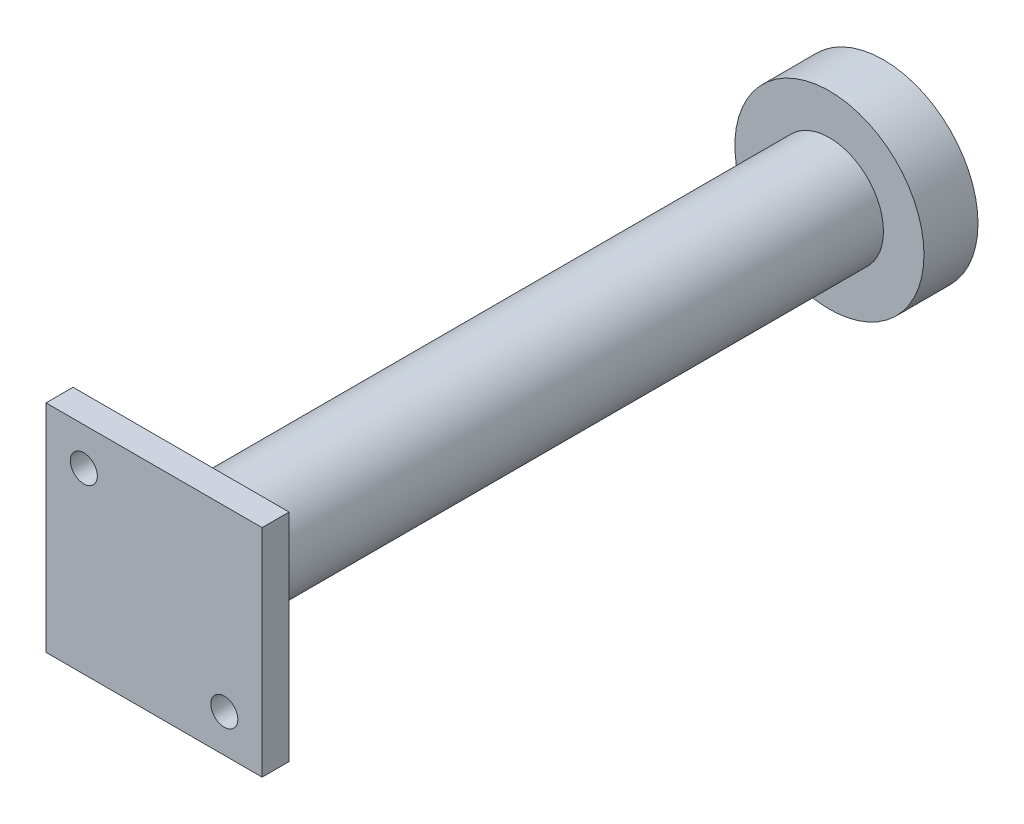
ISO-10303-21;
HEADER;
FILE_DESCRIPTION(('STEP AP214'),'2;1');
FILE_NAME('part.step','',(''),(''),'','','');
FILE_SCHEMA(('AUTOMOTIVE_DESIGN { 1 0 10303 214 1 1 1 1 }'));
ENDSEC;
DATA;
#1=APPLICATION_CONTEXT('core data for automotive mechanical design processes');
#2=APPLICATION_PROTOCOL_DEFINITION('international standard','automotive_design',2000,#1);
#3=PRODUCT_CONTEXT('',#1,'mechanical');
#4=PRODUCT('Part','Part','',(#3));
#5=PRODUCT_RELATED_PRODUCT_CATEGORY('part','',(#4));
#6=PRODUCT_DEFINITION_FORMATION('','',#4);
#7=PRODUCT_DEFINITION_CONTEXT('part definition',#1,'design');
#8=PRODUCT_DEFINITION('design','',#6,#7);
#9=PRODUCT_DEFINITION_SHAPE('','',#8);
#10=(LENGTH_UNIT() NAMED_UNIT(*) SI_UNIT(.MILLI.,.METRE.));
#11=(NAMED_UNIT(*) PLANE_ANGLE_UNIT() SI_UNIT($,.RADIAN.));
#12=(NAMED_UNIT(*) SI_UNIT($,.STERADIAN.) SOLID_ANGLE_UNIT());
#13=UNCERTAINTY_MEASURE_WITH_UNIT(LENGTH_MEASURE(1.E-05),#10,'distance_accuracy_value','');
#14=(GEOMETRIC_REPRESENTATION_CONTEXT(3) GLOBAL_UNCERTAINTY_ASSIGNED_CONTEXT((#13)) GLOBAL_UNIT_ASSIGNED_CONTEXT((#10,
#11,#12)) REPRESENTATION_CONTEXT('',''));
#15=CARTESIAN_POINT('',(0.,0.,0.));
#16=DIRECTION('',(0.,0.,1.));
#17=DIRECTION('',(1.,0.,0.));
#18=AXIS2_PLACEMENT_3D('',#15,#16,#17);
#19=CARTESIAN_POINT('',(0.,0.,100.));
#20=DIRECTION('',(0.,0.,-1.));
#21=DIRECTION('',(-1.,0.,0.));
#22=AXIS2_PLACEMENT_3D('',#19,#20,#21);
#23=CYLINDRICAL_SURFACE('',#22,10.);
#24=CARTESIAN_POINT('',(0.,0.,100.));
#25=DIRECTION('',(0.,0.,1.));
#26=DIRECTION('',(1.,0.,0.));
#27=AXIS2_PLACEMENT_3D('',#24,#25,#26);
#28=CIRCLE('',#27,10.);
#29=CARTESIAN_POINT('',(10.,0.,100.));
#30=VERTEX_POINT('',#29);
#31=EDGE_CURVE('E12',#30,#30,#28,.T.);
#32=ORIENTED_EDGE('',*,*,#31,.F.);
#33=EDGE_LOOP('',(#32));
#34=FACE_BOUND('',#33,.T.);
#35=CARTESIAN_POINT('',(0.,0.,-20.));
#36=DIRECTION('',(0.,0.,1.));
#37=DIRECTION('',(1.,0.,0.));
#38=AXIS2_PLACEMENT_3D('',#35,#36,#37);
#39=CIRCLE('',#38,10.);
#40=CARTESIAN_POINT('',(10.,0.,-20.));
#41=VERTEX_POINT('',#40);
#42=EDGE_CURVE('E124',#41,#41,#39,.T.);
#43=ORIENTED_EDGE('',*,*,#42,.T.);
#44=EDGE_LOOP('',(#43));
#45=FACE_BOUND('',#44,.T.);
#46=ADVANCED_FACE('F34',(#34,#45),#23,.T.);
#47=CARTESIAN_POINT('',(0.,0.,100.));
#48=DIRECTION('',(0.,0.,1.));
#49=DIRECTION('',(1.,0.,0.));
#50=AXIS2_PLACEMENT_3D('',#47,#48,#49);
#51=PLANE('',#50);
#52=CARTESIAN_POINT('',(13.,-13.,100.));
#53=DIRECTION('',(0.,0.,1.));
#54=DIRECTION('',(1.,0.,0.));
#55=AXIS2_PLACEMENT_3D('',#52,#53,#54);
#56=CIRCLE('',#55,2.5);
#57=CARTESIAN_POINT('',(15.5,-13.,100.));
#58=VERTEX_POINT('',#57);
#59=EDGE_CURVE('E126',#58,#58,#56,.T.);
#60=ORIENTED_EDGE('',*,*,#59,.T.);
#61=EDGE_LOOP('',(#60));
#62=FACE_BOUND('',#61,.T.);
#63=CARTESIAN_POINT('',(-13.,13.,100.));
#64=DIRECTION('',(0.,0.,1.));
#65=DIRECTION('',(1.,0.,0.));
#66=AXIS2_PLACEMENT_3D('',#63,#64,#65);
#67=CIRCLE('',#66,2.5);
#68=CARTESIAN_POINT('',(-10.5,13.,100.));
#69=VERTEX_POINT('',#68);
#70=EDGE_CURVE('E105',#69,#69,#67,.T.);
#71=ORIENTED_EDGE('',*,*,#70,.T.);
#72=EDGE_LOOP('',(#71));
#73=FACE_BOUND('',#72,.T.);
#74=DIRECTION('',(0.,-1.,0.));
#75=VECTOR('',#74,1.);
#76=CARTESIAN_POINT('',(-20.,20.,100.));
#77=LINE('',#76,#75);
#78=CARTESIAN_POINT('',(-20.,20.,100.));
#79=VERTEX_POINT('',#78);
#80=CARTESIAN_POINT('',(-20.,-20.,100.));
#81=VERTEX_POINT('',#80);
#82=EDGE_CURVE('E102',#79,#81,#77,.T.);
#83=ORIENTED_EDGE('',*,*,#82,.F.);
#84=DIRECTION('',(-1.,0.,0.));
#85=VECTOR('',#84,1.);
#86=CARTESIAN_POINT('',(-20.,20.,100.));
#87=LINE('',#86,#85);
#88=CARTESIAN_POINT('',(20.,20.,100.));
#89=VERTEX_POINT('',#88);
#90=EDGE_CURVE('E74',#89,#79,#87,.T.);
#91=ORIENTED_EDGE('',*,*,#90,.F.);
#92=DIRECTION('',(0.,1.,0.));
#93=VECTOR('',#92,1.);
#94=CARTESIAN_POINT('',(20.,20.,100.));
#95=LINE('',#94,#93);
#96=CARTESIAN_POINT('',(20.,-20.,100.));
#97=VERTEX_POINT('',#96);
#98=EDGE_CURVE('E68',#97,#89,#95,.T.);
#99=ORIENTED_EDGE('',*,*,#98,.F.);
#100=DIRECTION('',(1.,0.,0.));
#101=VECTOR('',#100,1.);
#102=CARTESIAN_POINT('',(-20.,-20.,100.));
#103=LINE('',#102,#101);
#104=EDGE_CURVE('E92',#81,#97,#103,.T.);
#105=ORIENTED_EDGE('',*,*,#104,.F.);
#106=EDGE_LOOP('',(#83,#91,#99,#105));
#107=FACE_BOUND('',#106,.T.);
#108=ORIENTED_EDGE('',*,*,#31,.T.);
#109=EDGE_LOOP('',(#108));
#110=FACE_BOUND('',#109,.T.);
#111=ADVANCED_FACE('F158',(#62,#73,#107,#110),#51,.F.);
#112=CARTESIAN_POINT('',(-20.,20.,105.));
#113=DIRECTION('',(1.,0.,0.));
#114=DIRECTION('',(0.,1.,0.));
#115=AXIS2_PLACEMENT_3D('',#112,#113,#114);
#116=PLANE('',#115);
#117=ORIENTED_EDGE('',*,*,#82,.T.);
#118=DIRECTION('',(0.,0.,-1.));
#119=VECTOR('',#118,1.);
#120=CARTESIAN_POINT('',(-20.,-20.,105.));
#121=LINE('',#120,#119);
#122=CARTESIAN_POINT('',(-20.,-20.,105.));
#123=VERTEX_POINT('',#122);
#124=EDGE_CURVE('E93',#123,#81,#121,.T.);
#125=ORIENTED_EDGE('',*,*,#124,.F.);
#126=DIRECTION('',(0.,-1.,0.));
#127=VECTOR('',#126,1.);
#128=CARTESIAN_POINT('',(-20.,20.,105.));
#129=LINE('',#128,#127);
#130=CARTESIAN_POINT('',(-20.,20.,105.));
#131=VERTEX_POINT('',#130);
#132=EDGE_CURVE('E87',#131,#123,#129,.T.);
#133=ORIENTED_EDGE('',*,*,#132,.F.);
#134=DIRECTION('',(0.,0.,-1.));
#135=VECTOR('',#134,1.);
#136=CARTESIAN_POINT('',(-20.,20.,105.));
#137=LINE('',#136,#135);
#138=EDGE_CURVE('E98',#131,#79,#137,.T.);
#139=ORIENTED_EDGE('',*,*,#138,.T.);
#140=EDGE_LOOP('',(#117,#125,#133,#139));
#141=FACE_BOUND('',#140,.T.);
#142=ADVANCED_FACE('F165',(#141),#116,.F.);
#143=CARTESIAN_POINT('',(-20.,-20.,105.));
#144=DIRECTION('',(0.,1.,0.));
#145=DIRECTION('',(0.,0.,1.));
#146=AXIS2_PLACEMENT_3D('',#143,#144,#145);
#147=PLANE('',#146);
#148=ORIENTED_EDGE('',*,*,#104,.T.);
#149=DIRECTION('',(0.,0.,-1.));
#150=VECTOR('',#149,1.);
#151=CARTESIAN_POINT('',(20.,-20.,105.));
#152=LINE('',#151,#150);
#153=CARTESIAN_POINT('',(20.,-20.,105.));
#154=VERTEX_POINT('',#153);
#155=EDGE_CURVE('E90',#154,#97,#152,.T.);
#156=ORIENTED_EDGE('',*,*,#155,.F.);
#157=DIRECTION('',(1.,0.,0.));
#158=VECTOR('',#157,1.);
#159=CARTESIAN_POINT('',(-20.,-20.,105.));
#160=LINE('',#159,#158);
#161=EDGE_CURVE('E82',#123,#154,#160,.T.);
#162=ORIENTED_EDGE('',*,*,#161,.F.);
#163=ORIENTED_EDGE('',*,*,#124,.T.);
#164=EDGE_LOOP('',(#148,#156,#162,#163));
#165=FACE_BOUND('',#164,.T.);
#166=ADVANCED_FACE('F91',(#165),#147,.F.);
#167=CARTESIAN_POINT('',(20.,20.,105.));
#168=DIRECTION('',(-1.,0.,0.));
#169=DIRECTION('',(0.,-1.,0.));
#170=AXIS2_PLACEMENT_3D('',#167,#168,#169);
#171=PLANE('',#170);
#172=ORIENTED_EDGE('',*,*,#98,.T.);
#173=DIRECTION('',(0.,0.,-1.));
#174=VECTOR('',#173,1.);
#175=CARTESIAN_POINT('',(20.,20.,105.));
#176=LINE('',#175,#174);
#177=CARTESIAN_POINT('',(20.,20.,105.));
#178=VERTEX_POINT('',#177);
#179=EDGE_CURVE('E94',#178,#89,#176,.T.);
#180=ORIENTED_EDGE('',*,*,#179,.F.);
#181=DIRECTION('',(0.,1.,0.));
#182=VECTOR('',#181,1.);
#183=CARTESIAN_POINT('',(20.,20.,105.));
#184=LINE('',#183,#182);
#185=EDGE_CURVE('E85',#154,#178,#184,.T.);
#186=ORIENTED_EDGE('',*,*,#185,.F.);
#187=ORIENTED_EDGE('',*,*,#155,.T.);
#188=EDGE_LOOP('',(#172,#180,#186,#187));
#189=FACE_BOUND('',#188,.T.);
#190=ADVANCED_FACE('F96',(#189),#171,.F.);
#191=CARTESIAN_POINT('',(-20.,20.,105.));
#192=DIRECTION('',(0.,-1.,0.));
#193=DIRECTION('',(0.,0.,-1.));
#194=AXIS2_PLACEMENT_3D('',#191,#192,#193);
#195=PLANE('',#194);
#196=ORIENTED_EDGE('',*,*,#90,.T.);
#197=ORIENTED_EDGE('',*,*,#138,.F.);
#198=DIRECTION('',(-1.,0.,0.));
#199=VECTOR('',#198,1.);
#200=CARTESIAN_POINT('',(-20.,20.,105.));
#201=LINE('',#200,#199);
#202=EDGE_CURVE('E51',#178,#131,#201,.T.);
#203=ORIENTED_EDGE('',*,*,#202,.F.);
#204=ORIENTED_EDGE('',*,*,#179,.T.);
#205=EDGE_LOOP('',(#196,#197,#203,#204));
#206=FACE_BOUND('',#205,.T.);
#207=ADVANCED_FACE('F144',(#206),#195,.F.);
#208=CARTESIAN_POINT('',(0.,0.,105.));
#209=DIRECTION('',(0.,0.,1.));
#210=DIRECTION('',(1.,0.,0.));
#211=AXIS2_PLACEMENT_3D('',#208,#209,#210);
#212=PLANE('',#211);
#213=CARTESIAN_POINT('',(13.,-13.,105.));
#214=DIRECTION('',(0.,0.,1.));
#215=DIRECTION('',(1.,0.,0.));
#216=AXIS2_PLACEMENT_3D('',#213,#214,#215);
#217=CIRCLE('',#216,2.5);
#218=CARTESIAN_POINT('',(15.5,-13.,105.));
#219=VERTEX_POINT('',#218);
#220=EDGE_CURVE('E123',#219,#219,#217,.T.);
#221=ORIENTED_EDGE('',*,*,#220,.F.);
#222=EDGE_LOOP('',(#221));
#223=FACE_BOUND('',#222,.T.);
#224=CARTESIAN_POINT('',(-13.,13.,105.));
#225=DIRECTION('',(0.,0.,1.));
#226=DIRECTION('',(1.,0.,0.));
#227=AXIS2_PLACEMENT_3D('',#224,#225,#226);
#228=CIRCLE('',#227,2.5);
#229=CARTESIAN_POINT('',(-10.5,13.,105.));
#230=VERTEX_POINT('',#229);
#231=EDGE_CURVE('E134',#230,#230,#228,.T.);
#232=ORIENTED_EDGE('',*,*,#231,.F.);
#233=EDGE_LOOP('',(#232));
#234=FACE_BOUND('',#233,.T.);
#235=ORIENTED_EDGE('',*,*,#132,.T.);
#236=ORIENTED_EDGE('',*,*,#161,.T.);
#237=ORIENTED_EDGE('',*,*,#185,.T.);
#238=ORIENTED_EDGE('',*,*,#202,.T.);
#239=EDGE_LOOP('',(#235,#236,#237,#238));
#240=FACE_BOUND('',#239,.T.);
#241=ADVANCED_FACE('F83',(#223,#234,#240),#212,.T.);
#242=CARTESIAN_POINT('',(-13.,13.,100.));
#243=DIRECTION('',(0.,0.,1.));
#244=DIRECTION('',(1.,0.,0.));
#245=AXIS2_PLACEMENT_3D('',#242,#243,#244);
#246=CYLINDRICAL_SURFACE('',#245,2.5);
#247=ORIENTED_EDGE('',*,*,#70,.F.);
#248=EDGE_LOOP('',(#247));
#249=FACE_BOUND('',#248,.T.);
#250=ORIENTED_EDGE('',*,*,#231,.T.);
#251=EDGE_LOOP('',(#250));
#252=FACE_BOUND('',#251,.T.);
#253=ADVANCED_FACE('F141',(#249,#252),#246,.F.);
#254=CARTESIAN_POINT('',(13.,-13.,100.));
#255=DIRECTION('',(0.,0.,1.));
#256=DIRECTION('',(1.,0.,0.));
#257=AXIS2_PLACEMENT_3D('',#254,#255,#256);
#258=CYLINDRICAL_SURFACE('',#257,2.5);
#259=ORIENTED_EDGE('',*,*,#59,.F.);
#260=EDGE_LOOP('',(#259));
#261=FACE_BOUND('',#260,.T.);
#262=ORIENTED_EDGE('',*,*,#220,.T.);
#263=EDGE_LOOP('',(#262));
#264=FACE_BOUND('',#263,.T.);
#265=ADVANCED_FACE('F151',(#261,#264),#258,.F.);
#266=CARTESIAN_POINT('',(0.,0.,-20.));
#267=DIRECTION('',(0.,0.,1.));
#268=DIRECTION('',(1.,0.,0.));
#269=AXIS2_PLACEMENT_3D('',#266,#267,#268);
#270=PLANE('',#269);
#271=ORIENTED_EDGE('',*,*,#42,.F.);
#272=EDGE_LOOP('',(#271));
#273=FACE_BOUND('',#272,.T.);
#274=CARTESIAN_POINT('',(0.,0.,-20.));
#275=DIRECTION('',(0.,0.,1.));
#276=DIRECTION('',(1.,0.,0.));
#277=AXIS2_PLACEMENT_3D('',#274,#275,#276);
#278=CIRCLE('',#277,17.5);
#279=CARTESIAN_POINT('',(17.5,0.,-20.));
#280=VERTEX_POINT('',#279);
#281=EDGE_CURVE('E37',#280,#280,#278,.T.);
#282=ORIENTED_EDGE('',*,*,#281,.T.);
#283=EDGE_LOOP('',(#282));
#284=FACE_BOUND('',#283,.T.);
#285=ADVANCED_FACE('F181',(#273,#284),#270,.T.);
#286=CARTESIAN_POINT('',(0.,0.,-30.));
#287=DIRECTION('',(0.,0.,-1.));
#288=DIRECTION('',(-1.,0.,0.));
#289=AXIS2_PLACEMENT_3D('',#286,#287,#288);
#290=PLANE('',#289);
#291=CARTESIAN_POINT('',(0.,0.,-30.));
#292=DIRECTION('',(0.,0.,-1.));
#293=DIRECTION('',(-1.,0.,0.));
#294=AXIS2_PLACEMENT_3D('',#291,#292,#293);
#295=CIRCLE('',#294,17.5);
#296=CARTESIAN_POINT('',(-17.5,0.,-30.));
#297=VERTEX_POINT('',#296);
#298=EDGE_CURVE('E43',#297,#297,#295,.T.);
#299=ORIENTED_EDGE('',*,*,#298,.T.);
#300=EDGE_LOOP('',(#299));
#301=FACE_BOUND('',#300,.T.);
#302=ADVANCED_FACE('F115',(#301),#290,.T.);
#303=CARTESIAN_POINT('',(0.,0.,-30.));
#304=DIRECTION('',(0.,0.,1.));
#305=DIRECTION('',(1.,0.,0.));
#306=AXIS2_PLACEMENT_3D('',#303,#304,#305);
#307=CYLINDRICAL_SURFACE('',#306,17.5);
#308=ORIENTED_EDGE('',*,*,#298,.F.);
#309=EDGE_LOOP('',(#308));
#310=FACE_BOUND('',#309,.T.);
#311=ORIENTED_EDGE('',*,*,#281,.F.);
#312=EDGE_LOOP('',(#311));
#313=FACE_BOUND('',#312,.T.);
#314=ADVANCED_FACE('F117',(#310,#313),#307,.T.);
#315=CLOSED_SHELL('',(#46,#111,#142,#166,#190,#207,#241,#253,#265,#285,#302,#314));
#316=MANIFOLD_SOLID_BREP('B2',#315);
#317=ADVANCED_BREP_SHAPE_REPRESENTATION('',(#18,#316),#14);
#318=SHAPE_DEFINITION_REPRESENTATION(#9,#317);
ENDSEC;
END-ISO-10303-21;
